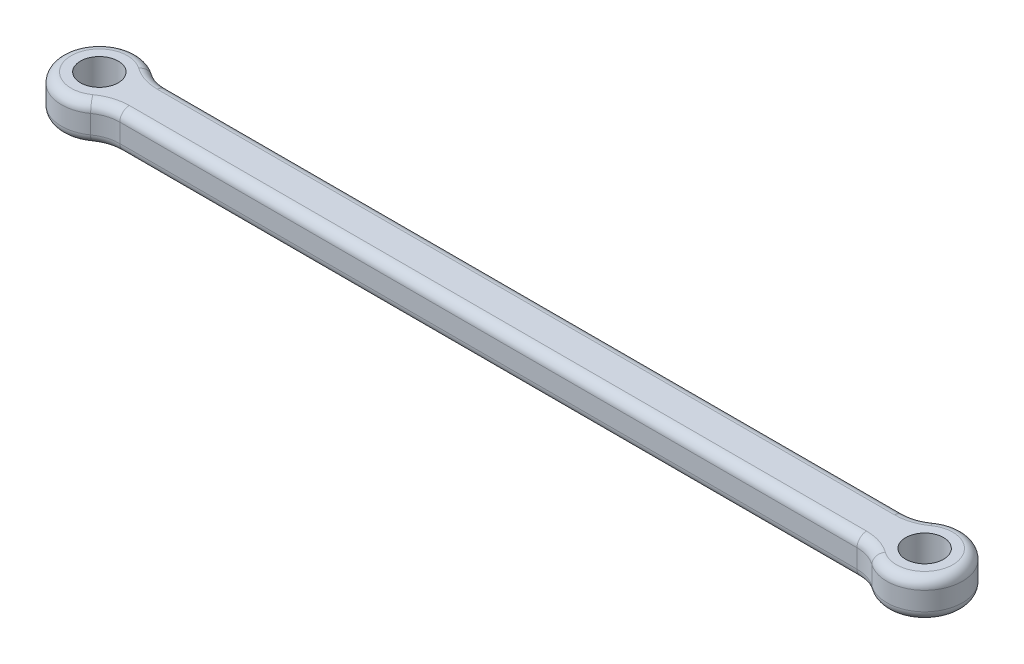
ISO-10303-21;
HEADER;
FILE_DESCRIPTION(('STEP AP214'),'2;1');
FILE_NAME('part.step','',(''),(''),'','','');
FILE_SCHEMA(('AUTOMOTIVE_DESIGN { 1 0 10303 214 1 1 1 1 }'));
ENDSEC;
DATA;
#1=APPLICATION_CONTEXT('core data for automotive mechanical design processes');
#2=APPLICATION_PROTOCOL_DEFINITION('international standard','automotive_design',2000,#1);
#3=PRODUCT_CONTEXT('',#1,'mechanical');
#4=PRODUCT('Part','Part','',(#3));
#5=PRODUCT_RELATED_PRODUCT_CATEGORY('part','',(#4));
#6=PRODUCT_DEFINITION_FORMATION('','',#4);
#7=PRODUCT_DEFINITION_CONTEXT('part definition',#1,'design');
#8=PRODUCT_DEFINITION('design','',#6,#7);
#9=PRODUCT_DEFINITION_SHAPE('','',#8);
#10=(LENGTH_UNIT() NAMED_UNIT(*) SI_UNIT(.MILLI.,.METRE.));
#11=(NAMED_UNIT(*) PLANE_ANGLE_UNIT() SI_UNIT($,.RADIAN.));
#12=(NAMED_UNIT(*) SI_UNIT($,.STERADIAN.) SOLID_ANGLE_UNIT());
#13=UNCERTAINTY_MEASURE_WITH_UNIT(LENGTH_MEASURE(1.E-05),#10,'distance_accuracy_value','');
#14=(GEOMETRIC_REPRESENTATION_CONTEXT(3) GLOBAL_UNCERTAINTY_ASSIGNED_CONTEXT((#13)) GLOBAL_UNIT_ASSIGNED_CONTEXT((#10,
#11,#12)) REPRESENTATION_CONTEXT('',''));
#15=CARTESIAN_POINT('',(0.,0.,0.));
#16=DIRECTION('',(0.,0.,1.));
#17=DIRECTION('',(1.,0.,0.));
#18=AXIS2_PLACEMENT_3D('',#15,#16,#17);
#19=CARTESIAN_POINT('',(-9.7801122812017,8.3,-10.725));
#20=DIRECTION('',(0.,1.,0.));
#21=DIRECTION('',(0.,0.,1.));
#22=AXIS2_PLACEMENT_3D('',#19,#20,#21);
#23=PLANE('',#22);
#24=CARTESIAN_POINT('',(119.000112281202,8.3,10.725));
#25=DIRECTION('',(0.,1.,0.));
#26=DIRECTION('',(0.,0.,1.));
#27=AXIS2_PLACEMENT_3D('',#24,#25,#26);
#28=CIRCLE('',#27,8.2764);
#29=CARTESIAN_POINT('',(119.000112281202,8.3,2.4486));
#30=VERTEX_POINT('',#29);
#31=CARTESIAN_POINT('',(123.824932280888,8.3,4.00042499999999));
#32=VERTEX_POINT('',#31);
#33=EDGE_CURVE('E268',#30,#32,#28,.F.);
#34=ORIENTED_EDGE('',*,*,#33,.T.);
#35=CARTESIAN_POINT('',(126.6952,8.3,0.));
#36=DIRECTION('',(0.,1.,0.));
#37=DIRECTION('',(0.,0.,1.));
#38=AXIS2_PLACEMENT_3D('',#35,#36,#37);
#39=CIRCLE('',#38,4.9236);
#40=CARTESIAN_POINT('',(123.824932280888,8.3,-4.00042499999999));
#41=VERTEX_POINT('',#40);
#42=EDGE_CURVE('E155',#32,#41,#39,.T.);
#43=ORIENTED_EDGE('',*,*,#42,.T.);
#44=CARTESIAN_POINT('',(119.000112281202,8.3,-10.725));
#45=DIRECTION('',(0.,1.,0.));
#46=DIRECTION('',(0.,0.,1.));
#47=AXIS2_PLACEMENT_3D('',#44,#45,#46);
#48=CIRCLE('',#47,8.2764);
#49=CARTESIAN_POINT('',(119.000112281202,8.3,-2.4486));
#50=VERTEX_POINT('',#49);
#51=EDGE_CURVE('E149',#41,#50,#48,.F.);
#52=ORIENTED_EDGE('',*,*,#51,.T.);
#53=DIRECTION('',(-1.,0.,0.));
#54=VECTOR('',#53,1.);
#55=CARTESIAN_POINT('',(-9.7801122812017,8.3,-2.4486));
#56=LINE('',#55,#54);
#57=CARTESIAN_POINT('',(-9.7801122812017,8.3,-2.4486));
#58=VERTEX_POINT('',#57);
#59=EDGE_CURVE('E152',#50,#58,#56,.T.);
#60=ORIENTED_EDGE('',*,*,#59,.T.);
#61=CARTESIAN_POINT('',(-9.7801122812017,8.3,-10.725));
#62=DIRECTION('',(0.,1.,0.));
#63=DIRECTION('',(0.,0.,1.));
#64=AXIS2_PLACEMENT_3D('',#61,#62,#63);
#65=CIRCLE('',#64,8.2764);
#66=CARTESIAN_POINT('',(-14.6049322808882,8.3,-4.000425));
#67=VERTEX_POINT('',#66);
#68=EDGE_CURVE('E159',#58,#67,#65,.F.);
#69=ORIENTED_EDGE('',*,*,#68,.T.);
#70=CARTESIAN_POINT('',(-17.4752,8.3,0.));
#71=DIRECTION('',(0.,1.,0.));
#72=DIRECTION('',(0.,0.,1.));
#73=AXIS2_PLACEMENT_3D('',#70,#71,#72);
#74=CIRCLE('',#73,4.9236);
#75=CARTESIAN_POINT('',(-14.6049322808882,8.3,4.000425));
#76=VERTEX_POINT('',#75);
#77=EDGE_CURVE('E274',#67,#76,#74,.T.);
#78=ORIENTED_EDGE('',*,*,#77,.T.);
#79=CARTESIAN_POINT('',(-9.7801122812017,8.3,10.725));
#80=DIRECTION('',(0.,1.,0.));
#81=DIRECTION('',(0.,0.,1.));
#82=AXIS2_PLACEMENT_3D('',#79,#80,#81);
#83=CIRCLE('',#82,8.2764);
#84=CARTESIAN_POINT('',(-9.7801122812017,8.3,2.4486));
#85=VERTEX_POINT('',#84);
#86=EDGE_CURVE('E272',#76,#85,#83,.F.);
#87=ORIENTED_EDGE('',*,*,#86,.T.);
#88=DIRECTION('',(1.,0.,0.));
#89=VECTOR('',#88,1.);
#90=CARTESIAN_POINT('',(119.000112281202,8.3,2.4486));
#91=LINE('',#90,#89);
#92=EDGE_CURVE('E270',#85,#30,#91,.T.);
#93=ORIENTED_EDGE('',*,*,#92,.T.);
#94=EDGE_LOOP('',(#34,#43,#52,#60,#69,#78,#87,#93));
#95=FACE_BOUND('',#94,.T.);
#96=CARTESIAN_POINT('',(-17.4752,8.3,0.));
#97=DIRECTION('',(0.,1.,0.));
#98=DIRECTION('',(0.,0.,1.));
#99=AXIS2_PLACEMENT_3D('',#96,#97,#98);
#100=CIRCLE('',#99,3.3);
#101=CARTESIAN_POINT('',(-17.4752,8.3,3.3));
#102=VERTEX_POINT('',#101);
#103=EDGE_CURVE('E298',#102,#102,#100,.T.);
#104=ORIENTED_EDGE('',*,*,#103,.F.);
#105=EDGE_LOOP('',(#104));
#106=FACE_BOUND('',#105,.T.);
#107=CARTESIAN_POINT('',(126.6952,8.3,0.));
#108=DIRECTION('',(0.,1.,0.));
#109=DIRECTION('',(0.,0.,-1.));
#110=AXIS2_PLACEMENT_3D('',#107,#108,#109);
#111=CIRCLE('',#110,3.29999999999999);
#112=CARTESIAN_POINT('',(126.6952,8.3,-3.29999999999999));
#113=VERTEX_POINT('',#112);
#114=EDGE_CURVE('E302',#113,#113,#111,.T.);
#115=ORIENTED_EDGE('',*,*,#114,.F.);
#116=EDGE_LOOP('',(#115));
#117=FACE_BOUND('',#116,.T.);
#118=ADVANCED_FACE('F34',(#95,#106,#117),#23,.T.);
#119=CARTESIAN_POINT('',(-9.7801122812017,1.7,-10.725));
#120=DIRECTION('',(0.,1.,0.));
#121=DIRECTION('',(0.,0.,1.));
#122=AXIS2_PLACEMENT_3D('',#119,#120,#121);
#123=PLANE('',#122);
#124=CARTESIAN_POINT('',(-9.7801122812017,1.7,10.725));
#125=DIRECTION('',(0.,1.,0.));
#126=DIRECTION('',(0.,0.,1.));
#127=AXIS2_PLACEMENT_3D('',#124,#125,#126);
#128=CIRCLE('',#127,8.2764);
#129=CARTESIAN_POINT('',(-9.7801122812017,1.7,2.4486));
#130=VERTEX_POINT('',#129);
#131=CARTESIAN_POINT('',(-14.6049322808882,1.7,4.000425));
#132=VERTEX_POINT('',#131);
#133=EDGE_CURVE('E227',#130,#132,#128,.T.);
#134=ORIENTED_EDGE('',*,*,#133,.T.);
#135=CARTESIAN_POINT('',(-17.4752,1.7,0.));
#136=DIRECTION('',(0.,1.,0.));
#137=DIRECTION('',(0.,0.,1.));
#138=AXIS2_PLACEMENT_3D('',#135,#136,#137);
#139=CIRCLE('',#138,4.9236);
#140=CARTESIAN_POINT('',(-14.6049322808882,1.7,-4.000425));
#141=VERTEX_POINT('',#140);
#142=EDGE_CURVE('E224',#132,#141,#139,.F.);
#143=ORIENTED_EDGE('',*,*,#142,.T.);
#144=CARTESIAN_POINT('',(-9.7801122812017,1.7,-10.725));
#145=DIRECTION('',(0.,1.,0.));
#146=DIRECTION('',(0.,0.,1.));
#147=AXIS2_PLACEMENT_3D('',#144,#145,#146);
#148=CIRCLE('',#147,8.2764);
#149=CARTESIAN_POINT('',(-9.7801122812017,1.7,-2.4486));
#150=VERTEX_POINT('',#149);
#151=EDGE_CURVE('E239',#141,#150,#148,.T.);
#152=ORIENTED_EDGE('',*,*,#151,.T.);
#153=DIRECTION('',(-1.,0.,0.));
#154=VECTOR('',#153,1.);
#155=CARTESIAN_POINT('',(-9.7801122812017,1.7,-2.4486));
#156=LINE('',#155,#154);
#157=CARTESIAN_POINT('',(119.000112281202,1.7,-2.4486));
#158=VERTEX_POINT('',#157);
#159=EDGE_CURVE('E237',#150,#158,#156,.F.);
#160=ORIENTED_EDGE('',*,*,#159,.T.);
#161=CARTESIAN_POINT('',(119.000112281202,1.7,-10.725));
#162=DIRECTION('',(0.,1.,0.));
#163=DIRECTION('',(0.,0.,1.));
#164=AXIS2_PLACEMENT_3D('',#161,#162,#163);
#165=CIRCLE('',#164,8.2764);
#166=CARTESIAN_POINT('',(123.824932280888,1.7,-4.00042499999999));
#167=VERTEX_POINT('',#166);
#168=EDGE_CURVE('E235',#158,#167,#165,.T.);
#169=ORIENTED_EDGE('',*,*,#168,.T.);
#170=CARTESIAN_POINT('',(126.6952,1.7,0.));
#171=DIRECTION('',(0.,1.,0.));
#172=DIRECTION('',(0.,0.,1.));
#173=AXIS2_PLACEMENT_3D('',#170,#171,#172);
#174=CIRCLE('',#173,4.9236);
#175=CARTESIAN_POINT('',(123.824932280888,1.7,4.00042499999999));
#176=VERTEX_POINT('',#175);
#177=EDGE_CURVE('E233',#167,#176,#174,.F.);
#178=ORIENTED_EDGE('',*,*,#177,.T.);
#179=CARTESIAN_POINT('',(119.000112281202,1.7,10.725));
#180=DIRECTION('',(0.,1.,0.));
#181=DIRECTION('',(0.,0.,1.));
#182=AXIS2_PLACEMENT_3D('',#179,#180,#181);
#183=CIRCLE('',#182,8.2764);
#184=CARTESIAN_POINT('',(119.000112281202,1.7,2.4486));
#185=VERTEX_POINT('',#184);
#186=EDGE_CURVE('E231',#176,#185,#183,.T.);
#187=ORIENTED_EDGE('',*,*,#186,.T.);
#188=DIRECTION('',(1.,0.,0.));
#189=VECTOR('',#188,1.);
#190=CARTESIAN_POINT('',(-9.7801122812017,1.7,2.4486));
#191=LINE('',#190,#189);
#192=EDGE_CURVE('E229',#185,#130,#191,.F.);
#193=ORIENTED_EDGE('',*,*,#192,.T.);
#194=EDGE_LOOP('',(#134,#143,#152,#160,#169,#178,#187,#193));
#195=FACE_BOUND('',#194,.T.);
#196=CARTESIAN_POINT('',(-17.4752,1.7,0.));
#197=DIRECTION('',(0.,1.,0.));
#198=DIRECTION('',(0.,0.,1.));
#199=AXIS2_PLACEMENT_3D('',#196,#197,#198);
#200=CIRCLE('',#199,3.3);
#201=CARTESIAN_POINT('',(-17.4752,1.7,3.3));
#202=VERTEX_POINT('',#201);
#203=EDGE_CURVE('E299',#202,#202,#200,.T.);
#204=ORIENTED_EDGE('',*,*,#203,.T.);
#205=EDGE_LOOP('',(#204));
#206=FACE_BOUND('',#205,.T.);
#207=CARTESIAN_POINT('',(126.6952,1.7,0.));
#208=DIRECTION('',(0.,1.,0.));
#209=DIRECTION('',(0.,0.,-1.));
#210=AXIS2_PLACEMENT_3D('',#207,#208,#209);
#211=CIRCLE('',#210,3.29999999999999);
#212=CARTESIAN_POINT('',(126.6952,1.7,-3.29999999999999));
#213=VERTEX_POINT('',#212);
#214=EDGE_CURVE('E192',#213,#213,#211,.T.);
#215=ORIENTED_EDGE('',*,*,#214,.T.);
#216=EDGE_LOOP('',(#215));
#217=FACE_BOUND('',#216,.T.);
#218=ADVANCED_FACE('F314',(#195,#206,#217),#123,.F.);
#219=CARTESIAN_POINT('',(-9.7801122812017,8.3,-10.725));
#220=DIRECTION('',(0.,-1.,0.));
#221=DIRECTION('',(0.,0.,-1.));
#222=AXIS2_PLACEMENT_3D('',#219,#220,#221);
#223=CYLINDRICAL_SURFACE('',#222,6.6);
#224=DIRECTION('',(0.,-1.,0.));
#225=VECTOR('',#224,1.);
#226=CARTESIAN_POINT('',(-13.6276561406008,8.3,-5.3625));
#227=LINE('',#226,#225);
#228=CARTESIAN_POINT('',(-13.6276561406008,6.6236,-5.3625));
#229=VERTEX_POINT('',#228);
#230=CARTESIAN_POINT('',(-13.6276561406008,3.3764,-5.3625));
#231=VERTEX_POINT('',#230);
#232=EDGE_CURVE('E169',#229,#231,#227,.T.);
#233=ORIENTED_EDGE('',*,*,#232,.F.);
#234=CARTESIAN_POINT('',(-9.7801122812017,6.6236,-10.725));
#235=DIRECTION('',(0.,1.,0.));
#236=DIRECTION('',(0.,0.,1.));
#237=AXIS2_PLACEMENT_3D('',#234,#235,#236);
#238=CIRCLE('',#237,6.6);
#239=CARTESIAN_POINT('',(-9.7801122812017,6.6236,-4.125));
#240=VERTEX_POINT('',#239);
#241=EDGE_CURVE('E241',#229,#240,#238,.T.);
#242=ORIENTED_EDGE('',*,*,#241,.T.);
#243=DIRECTION('',(0.,-1.,0.));
#244=VECTOR('',#243,1.);
#245=CARTESIAN_POINT('',(-9.7801122812017,8.3,-4.125));
#246=LINE('',#245,#244);
#247=CARTESIAN_POINT('',(-9.7801122812017,3.3764,-4.125));
#248=VERTEX_POINT('',#247);
#249=EDGE_CURVE('E295',#240,#248,#246,.T.);
#250=ORIENTED_EDGE('',*,*,#249,.T.);
#251=CARTESIAN_POINT('',(-9.7801122812017,3.3764,-10.725));
#252=DIRECTION('',(0.,1.,0.));
#253=DIRECTION('',(0.,0.,1.));
#254=AXIS2_PLACEMENT_3D('',#251,#252,#253);
#255=CIRCLE('',#254,6.6);
#256=EDGE_CURVE('E243',#248,#231,#255,.F.);
#257=ORIENTED_EDGE('',*,*,#256,.T.);
#258=EDGE_LOOP('',(#233,#242,#250,#257));
#259=FACE_BOUND('',#258,.T.);
#260=ADVANCED_FACE('F319',(#259),#223,.F.);
#261=CARTESIAN_POINT('',(-17.4752,8.3,0.));
#262=DIRECTION('',(0.,-1.,0.));
#263=DIRECTION('',(0.,0.,-1.));
#264=AXIS2_PLACEMENT_3D('',#261,#262,#263);
#265=CYLINDRICAL_SURFACE('',#264,6.6);
#266=DIRECTION('',(0.,-1.,0.));
#267=VECTOR('',#266,1.);
#268=CARTESIAN_POINT('',(-13.6276561406008,8.3,5.3625));
#269=LINE('',#268,#267);
#270=CARTESIAN_POINT('',(-13.6276561406008,6.6236,5.3625));
#271=VERTEX_POINT('',#270);
#272=CARTESIAN_POINT('',(-13.6276561406008,3.3764,5.3625));
#273=VERTEX_POINT('',#272);
#274=EDGE_CURVE('E279',#271,#273,#269,.T.);
#275=ORIENTED_EDGE('',*,*,#274,.F.);
#276=CARTESIAN_POINT('',(-17.4752,6.6236,0.));
#277=DIRECTION('',(0.,1.,0.));
#278=DIRECTION('',(0.,0.,1.));
#279=AXIS2_PLACEMENT_3D('',#276,#277,#278);
#280=CIRCLE('',#279,6.6);
#281=EDGE_CURVE('E245',#271,#229,#280,.F.);
#282=ORIENTED_EDGE('',*,*,#281,.T.);
#283=ORIENTED_EDGE('',*,*,#232,.T.);
#284=CARTESIAN_POINT('',(-17.4752,3.3764,0.));
#285=DIRECTION('',(0.,1.,0.));
#286=DIRECTION('',(0.,0.,1.));
#287=AXIS2_PLACEMENT_3D('',#284,#285,#286);
#288=CIRCLE('',#287,6.6);
#289=EDGE_CURVE('E247',#231,#273,#288,.T.);
#290=ORIENTED_EDGE('',*,*,#289,.T.);
#291=EDGE_LOOP('',(#275,#282,#283,#290));
#292=FACE_BOUND('',#291,.T.);
#293=ADVANCED_FACE('F347',(#292),#265,.T.);
#294=CARTESIAN_POINT('',(-9.7801122812017,8.3,10.725));
#295=DIRECTION('',(0.,-1.,0.));
#296=DIRECTION('',(0.,0.,-1.));
#297=AXIS2_PLACEMENT_3D('',#294,#295,#296);
#298=CYLINDRICAL_SURFACE('',#297,6.6);
#299=DIRECTION('',(0.,-1.,0.));
#300=VECTOR('',#299,1.);
#301=CARTESIAN_POINT('',(-9.7801122812017,8.3,4.125));
#302=LINE('',#301,#300);
#303=CARTESIAN_POINT('',(-9.7801122812017,6.6236,4.125));
#304=VERTEX_POINT('',#303);
#305=CARTESIAN_POINT('',(-9.7801122812017,3.3764,4.125));
#306=VERTEX_POINT('',#305);
#307=EDGE_CURVE('E282',#304,#306,#302,.T.);
#308=ORIENTED_EDGE('',*,*,#307,.F.);
#309=CARTESIAN_POINT('',(-9.7801122812017,6.6236,10.725));
#310=DIRECTION('',(0.,1.,0.));
#311=DIRECTION('',(0.,0.,1.));
#312=AXIS2_PLACEMENT_3D('',#309,#310,#311);
#313=CIRCLE('',#312,6.6);
#314=EDGE_CURVE('E250',#304,#271,#313,.T.);
#315=ORIENTED_EDGE('',*,*,#314,.T.);
#316=ORIENTED_EDGE('',*,*,#274,.T.);
#317=CARTESIAN_POINT('',(-9.7801122812017,3.3764,10.725));
#318=DIRECTION('',(0.,1.,0.));
#319=DIRECTION('',(0.,0.,1.));
#320=AXIS2_PLACEMENT_3D('',#317,#318,#319);
#321=CIRCLE('',#320,6.6);
#322=EDGE_CURVE('E252',#273,#306,#321,.F.);
#323=ORIENTED_EDGE('',*,*,#322,.T.);
#324=EDGE_LOOP('',(#308,#315,#316,#323));
#325=FACE_BOUND('',#324,.T.);
#326=ADVANCED_FACE('F343',(#325),#298,.F.);
#327=CARTESIAN_POINT('',(-9.7801122812017,8.3,4.125));
#328=DIRECTION('',(0.,0.,-1.));
#329=DIRECTION('',(-1.,0.,0.));
#330=AXIS2_PLACEMENT_3D('',#327,#328,#329);
#331=PLANE('',#330);
#332=DIRECTION('',(0.,-1.,0.));
#333=VECTOR('',#332,1.);
#334=CARTESIAN_POINT('',(119.000112281202,8.3,4.125));
#335=LINE('',#334,#333);
#336=CARTESIAN_POINT('',(119.000112281202,6.6236,4.125));
#337=VERTEX_POINT('',#336);
#338=CARTESIAN_POINT('',(119.000112281202,3.3764,4.125));
#339=VERTEX_POINT('',#338);
#340=EDGE_CURVE('E285',#337,#339,#335,.T.);
#341=ORIENTED_EDGE('',*,*,#340,.F.);
#342=DIRECTION('',(1.,0.,0.));
#343=VECTOR('',#342,1.);
#344=CARTESIAN_POINT('',(-9.7801122812017,6.6236,4.125));
#345=LINE('',#344,#343);
#346=EDGE_CURVE('E254',#337,#304,#345,.F.);
#347=ORIENTED_EDGE('',*,*,#346,.T.);
#348=ORIENTED_EDGE('',*,*,#307,.T.);
#349=DIRECTION('',(1.,0.,0.));
#350=VECTOR('',#349,1.);
#351=CARTESIAN_POINT('',(-9.7801122812017,3.3764,4.125));
#352=LINE('',#351,#350);
#353=EDGE_CURVE('E256',#306,#339,#352,.T.);
#354=ORIENTED_EDGE('',*,*,#353,.T.);
#355=EDGE_LOOP('',(#341,#347,#348,#354));
#356=FACE_BOUND('',#355,.T.);
#357=ADVANCED_FACE('F339',(#356),#331,.F.);
#358=CARTESIAN_POINT('',(119.000112281202,8.3,10.725));
#359=DIRECTION('',(0.,-1.,0.));
#360=DIRECTION('',(0.,0.,-1.));
#361=AXIS2_PLACEMENT_3D('',#358,#359,#360);
#362=CYLINDRICAL_SURFACE('',#361,6.6);
#363=DIRECTION('',(0.,-1.,0.));
#364=VECTOR('',#363,1.);
#365=CARTESIAN_POINT('',(122.847656140601,8.3,5.36249999999999));
#366=LINE('',#365,#364);
#367=CARTESIAN_POINT('',(122.847656140601,6.6236,5.36249999999999));
#368=VERTEX_POINT('',#367);
#369=CARTESIAN_POINT('',(122.847656140601,3.3764,5.36249999999999));
#370=VERTEX_POINT('',#369);
#371=EDGE_CURVE('E288',#368,#370,#366,.T.);
#372=ORIENTED_EDGE('',*,*,#371,.F.);
#373=CARTESIAN_POINT('',(119.000112281202,6.6236,10.725));
#374=DIRECTION('',(0.,1.,0.));
#375=DIRECTION('',(0.,0.,1.));
#376=AXIS2_PLACEMENT_3D('',#373,#374,#375);
#377=CIRCLE('',#376,6.6);
#378=EDGE_CURVE('E258',#368,#337,#377,.T.);
#379=ORIENTED_EDGE('',*,*,#378,.T.);
#380=ORIENTED_EDGE('',*,*,#340,.T.);
#381=CARTESIAN_POINT('',(119.000112281202,3.3764,10.725));
#382=DIRECTION('',(0.,1.,0.));
#383=DIRECTION('',(0.,0.,1.));
#384=AXIS2_PLACEMENT_3D('',#381,#382,#383);
#385=CIRCLE('',#384,6.6);
#386=EDGE_CURVE('E260',#339,#370,#385,.F.);
#387=ORIENTED_EDGE('',*,*,#386,.T.);
#388=EDGE_LOOP('',(#372,#379,#380,#387));
#389=FACE_BOUND('',#388,.T.);
#390=ADVANCED_FACE('F335',(#389),#362,.F.);
#391=CARTESIAN_POINT('',(126.6952,8.3,0.));
#392=DIRECTION('',(0.,-1.,0.));
#393=DIRECTION('',(0.,0.,-1.));
#394=AXIS2_PLACEMENT_3D('',#391,#392,#393);
#395=CYLINDRICAL_SURFACE('',#394,6.6);
#396=DIRECTION('',(0.,-1.,0.));
#397=VECTOR('',#396,1.);
#398=CARTESIAN_POINT('',(122.847656140601,8.3,-5.3625));
#399=LINE('',#398,#397);
#400=CARTESIAN_POINT('',(122.847656140601,6.6236,-5.3625));
#401=VERTEX_POINT('',#400);
#402=CARTESIAN_POINT('',(122.847656140601,3.3764,-5.3625));
#403=VERTEX_POINT('',#402);
#404=EDGE_CURVE('E291',#401,#403,#399,.T.);
#405=ORIENTED_EDGE('',*,*,#404,.F.);
#406=CARTESIAN_POINT('',(126.6952,6.6236,0.));
#407=DIRECTION('',(0.,1.,0.));
#408=DIRECTION('',(0.,0.,1.));
#409=AXIS2_PLACEMENT_3D('',#406,#407,#408);
#410=CIRCLE('',#409,6.6);
#411=EDGE_CURVE('E262',#401,#368,#410,.F.);
#412=ORIENTED_EDGE('',*,*,#411,.T.);
#413=ORIENTED_EDGE('',*,*,#371,.T.);
#414=CARTESIAN_POINT('',(126.6952,3.3764,0.));
#415=DIRECTION('',(0.,1.,0.));
#416=DIRECTION('',(0.,0.,1.));
#417=AXIS2_PLACEMENT_3D('',#414,#415,#416);
#418=CIRCLE('',#417,6.6);
#419=EDGE_CURVE('E265',#370,#403,#418,.T.);
#420=ORIENTED_EDGE('',*,*,#419,.T.);
#421=EDGE_LOOP('',(#405,#412,#413,#420));
#422=FACE_BOUND('',#421,.T.);
#423=ADVANCED_FACE('F332',(#422),#395,.T.);
#424=CARTESIAN_POINT('',(119.000112281202,8.3,-10.725));
#425=DIRECTION('',(0.,-1.,0.));
#426=DIRECTION('',(0.,0.,-1.));
#427=AXIS2_PLACEMENT_3D('',#424,#425,#426);
#428=CYLINDRICAL_SURFACE('',#427,6.6);
#429=ORIENTED_EDGE('',*,*,#404,.T.);
#430=CARTESIAN_POINT('',(119.000112281202,3.3764,-10.725));
#431=DIRECTION('',(0.,1.,0.));
#432=DIRECTION('',(0.,0.,1.));
#433=AXIS2_PLACEMENT_3D('',#430,#431,#432);
#434=CIRCLE('',#433,6.6);
#435=CARTESIAN_POINT('',(119.000112281202,3.3764,-4.125));
#436=VERTEX_POINT('',#435);
#437=EDGE_CURVE('E51',#403,#436,#434,.F.);
#438=ORIENTED_EDGE('',*,*,#437,.T.);
#439=DIRECTION('',(0.,-1.,0.));
#440=VECTOR('',#439,1.);
#441=CARTESIAN_POINT('',(119.000112281202,8.3,-4.125));
#442=LINE('',#441,#440);
#443=CARTESIAN_POINT('',(119.000112281202,6.6236,-4.125));
#444=VERTEX_POINT('',#443);
#445=EDGE_CURVE('E293',#444,#436,#442,.T.);
#446=ORIENTED_EDGE('',*,*,#445,.F.);
#447=CARTESIAN_POINT('',(119.000112281202,6.6236,-10.725));
#448=DIRECTION('',(0.,1.,0.));
#449=DIRECTION('',(0.,0.,1.));
#450=AXIS2_PLACEMENT_3D('',#447,#448,#449);
#451=CIRCLE('',#450,6.6);
#452=EDGE_CURVE('E172',#444,#401,#451,.T.);
#453=ORIENTED_EDGE('',*,*,#452,.T.);
#454=EDGE_LOOP('',(#429,#438,#446,#453));
#455=FACE_BOUND('',#454,.T.);
#456=ADVANCED_FACE('F329',(#455),#428,.F.);
#457=CARTESIAN_POINT('',(-9.7801122812017,8.3,-4.125));
#458=DIRECTION('',(0.,0.,1.));
#459=DIRECTION('',(1.,0.,0.));
#460=AXIS2_PLACEMENT_3D('',#457,#458,#459);
#461=PLANE('',#460);
#462=ORIENTED_EDGE('',*,*,#445,.T.);
#463=DIRECTION('',(-1.,0.,0.));
#464=VECTOR('',#463,1.);
#465=CARTESIAN_POINT('',(-9.7801122812017,3.3764,-4.125));
#466=LINE('',#465,#464);
#467=EDGE_CURVE('E11',#436,#248,#466,.T.);
#468=ORIENTED_EDGE('',*,*,#467,.T.);
#469=ORIENTED_EDGE('',*,*,#249,.F.);
#470=DIRECTION('',(-1.,0.,0.));
#471=VECTOR('',#470,1.);
#472=CARTESIAN_POINT('',(119.000112281202,6.6236,-4.125));
#473=LINE('',#472,#471);
#474=EDGE_CURVE('E43',#240,#444,#473,.F.);
#475=ORIENTED_EDGE('',*,*,#474,.T.);
#476=EDGE_LOOP('',(#462,#468,#469,#475));
#477=FACE_BOUND('',#476,.T.);
#478=ADVANCED_FACE('F326',(#477),#461,.F.);
#479=CARTESIAN_POINT('',(-17.4752,8.3,0.));
#480=DIRECTION('',(0.,-1.,0.));
#481=DIRECTION('',(0.,0.,-1.));
#482=AXIS2_PLACEMENT_3D('',#479,#480,#481);
#483=CYLINDRICAL_SURFACE('',#482,3.3);
#484=ORIENTED_EDGE('',*,*,#103,.T.);
#485=EDGE_LOOP('',(#484));
#486=FACE_BOUND('',#485,.T.);
#487=ORIENTED_EDGE('',*,*,#203,.F.);
#488=EDGE_LOOP('',(#487));
#489=FACE_BOUND('',#488,.T.);
#490=ADVANCED_FACE('F323',(#486,#489),#483,.F.);
#491=CARTESIAN_POINT('',(126.6952,8.3,0.));
#492=DIRECTION('',(0.,-1.,0.));
#493=DIRECTION('',(0.,0.,-1.));
#494=AXIS2_PLACEMENT_3D('',#491,#492,#493);
#495=CYLINDRICAL_SURFACE('',#494,3.29999999999999);
#496=ORIENTED_EDGE('',*,*,#114,.T.);
#497=EDGE_LOOP('',(#496));
#498=FACE_BOUND('',#497,.T.);
#499=ORIENTED_EDGE('',*,*,#214,.F.);
#500=EDGE_LOOP('',(#499));
#501=FACE_BOUND('',#500,.T.);
#502=ADVANCED_FACE('F310',(#498,#501),#495,.F.);
#503=CARTESIAN_POINT('',(-17.4752,6.6236,0.));
#504=DIRECTION('',(0.,1.,0.));
#505=DIRECTION('',(0.,0.,1.));
#506=AXIS2_PLACEMENT_3D('',#503,#504,#505);
#507=TOROIDAL_SURFACE('',#506,4.9236,1.6764);
#508=CARTESIAN_POINT('',(-14.6049322808882,6.6236,-4.000425));
#509=DIRECTION('',(0.812499999999999,0.,0.582961190818052));
#510=DIRECTION('',(0.582961190818052,0.,-0.812499999999999));
#511=AXIS2_PLACEMENT_3D('',#508,#509,#510);
#512=CIRCLE('',#511,1.6764);
#513=EDGE_CURVE('E186',#229,#67,#512,.T.);
#514=ORIENTED_EDGE('',*,*,#513,.F.);
#515=ORIENTED_EDGE('',*,*,#281,.F.);
#516=CARTESIAN_POINT('',(-14.6049322808882,6.6236,4.000425));
#517=DIRECTION('',(0.812499999999999,0.,-0.582961190818052));
#518=DIRECTION('',(-0.582961190818052,0.,-0.812499999999999));
#519=AXIS2_PLACEMENT_3D('',#516,#517,#518);
#520=CIRCLE('',#519,1.6764);
#521=EDGE_CURVE('E189',#76,#271,#520,.T.);
#522=ORIENTED_EDGE('',*,*,#521,.F.);
#523=ORIENTED_EDGE('',*,*,#77,.F.);
#524=EDGE_LOOP('',(#514,#515,#522,#523));
#525=FACE_BOUND('',#524,.T.);
#526=ADVANCED_FACE('F377',(#525),#507,.T.);
#527=CARTESIAN_POINT('',(-9.7801122812017,6.6236,10.725));
#528=DIRECTION('',(0.,1.,0.));
#529=DIRECTION('',(0.,0.,1.));
#530=AXIS2_PLACEMENT_3D('',#527,#528,#529);
#531=TOROIDAL_SURFACE('',#530,8.2764,1.6764);
#532=ORIENTED_EDGE('',*,*,#521,.T.);
#533=ORIENTED_EDGE('',*,*,#314,.F.);
#534=CARTESIAN_POINT('',(-9.7801122812017,6.6236,2.4486));
#535=DIRECTION('',(1.,0.,0.));
#536=DIRECTION('',(0.,0.,-1.));
#537=AXIS2_PLACEMENT_3D('',#534,#535,#536);
#538=CIRCLE('',#537,1.6764);
#539=EDGE_CURVE('E183',#85,#304,#538,.T.);
#540=ORIENTED_EDGE('',*,*,#539,.F.);
#541=ORIENTED_EDGE('',*,*,#86,.F.);
#542=EDGE_LOOP('',(#532,#533,#540,#541));
#543=FACE_BOUND('',#542,.T.);
#544=ADVANCED_FACE('F373',(#543),#531,.T.);
#545=CARTESIAN_POINT('',(-9.7801122812017,6.6236,-10.725));
#546=DIRECTION('',(0.,1.,0.));
#547=DIRECTION('',(0.,0.,1.));
#548=AXIS2_PLACEMENT_3D('',#545,#546,#547);
#549=TOROIDAL_SURFACE('',#548,8.2764,1.6764);
#550=ORIENTED_EDGE('',*,*,#513,.T.);
#551=ORIENTED_EDGE('',*,*,#68,.F.);
#552=CARTESIAN_POINT('',(-9.7801122812017,6.6236,-2.4486));
#553=DIRECTION('',(1.,0.,0.));
#554=DIRECTION('',(0.,0.,-1.));
#555=AXIS2_PLACEMENT_3D('',#552,#553,#554);
#556=CIRCLE('',#555,1.6764);
#557=EDGE_CURVE('E168',#240,#58,#556,.T.);
#558=ORIENTED_EDGE('',*,*,#557,.F.);
#559=ORIENTED_EDGE('',*,*,#241,.F.);
#560=EDGE_LOOP('',(#550,#551,#558,#559));
#561=FACE_BOUND('',#560,.T.);
#562=ADVANCED_FACE('F369',(#561),#549,.T.);
#563=CARTESIAN_POINT('',(-9.7801122812017,6.6236,2.4486));
#564=DIRECTION('',(-1.,0.,0.));
#565=DIRECTION('',(0.,0.,1.));
#566=AXIS2_PLACEMENT_3D('',#563,#564,#565);
#567=CYLINDRICAL_SURFACE('',#566,1.6764);
#568=ORIENTED_EDGE('',*,*,#539,.T.);
#569=ORIENTED_EDGE('',*,*,#346,.F.);
#570=CARTESIAN_POINT('',(119.000112281202,6.6236,2.4486));
#571=DIRECTION('',(1.,0.,0.));
#572=DIRECTION('',(0.,0.,-1.));
#573=AXIS2_PLACEMENT_3D('',#570,#571,#572);
#574=CIRCLE('',#573,1.6764);
#575=EDGE_CURVE('E173',#30,#337,#574,.T.);
#576=ORIENTED_EDGE('',*,*,#575,.F.);
#577=ORIENTED_EDGE('',*,*,#92,.F.);
#578=EDGE_LOOP('',(#568,#569,#576,#577));
#579=FACE_BOUND('',#578,.T.);
#580=ADVANCED_FACE('F366',(#579),#567,.T.);
#581=CARTESIAN_POINT('',(-9.7801122812017,6.6236,-2.4486));
#582=DIRECTION('',(1.,0.,0.));
#583=DIRECTION('',(0.,0.,-1.));
#584=AXIS2_PLACEMENT_3D('',#581,#582,#583);
#585=CYLINDRICAL_SURFACE('',#584,1.6764);
#586=ORIENTED_EDGE('',*,*,#557,.T.);
#587=ORIENTED_EDGE('',*,*,#59,.F.);
#588=CARTESIAN_POINT('',(119.000112281202,6.6236,-2.4486));
#589=DIRECTION('',(1.,0.,0.));
#590=DIRECTION('',(0.,0.,-1.));
#591=AXIS2_PLACEMENT_3D('',#588,#589,#590);
#592=CIRCLE('',#591,1.6764);
#593=EDGE_CURVE('E165',#444,#50,#592,.T.);
#594=ORIENTED_EDGE('',*,*,#593,.F.);
#595=ORIENTED_EDGE('',*,*,#474,.F.);
#596=EDGE_LOOP('',(#586,#587,#594,#595));
#597=FACE_BOUND('',#596,.T.);
#598=ADVANCED_FACE('F164',(#597),#585,.T.);
#599=CARTESIAN_POINT('',(119.000112281202,6.6236,10.725));
#600=DIRECTION('',(0.,1.,0.));
#601=DIRECTION('',(0.,0.,1.));
#602=AXIS2_PLACEMENT_3D('',#599,#600,#601);
#603=TOROIDAL_SURFACE('',#602,8.2764,1.6764);
#604=ORIENTED_EDGE('',*,*,#575,.T.);
#605=ORIENTED_EDGE('',*,*,#378,.F.);
#606=CARTESIAN_POINT('',(123.824932280888,6.6236,4.00042499999999));
#607=DIRECTION('',(0.812500000000003,0.,0.582961190818047));
#608=DIRECTION('',(0.582961190818047,0.,-0.812500000000003));
#609=AXIS2_PLACEMENT_3D('',#606,#607,#608);
#610=CIRCLE('',#609,1.6764);
#611=EDGE_CURVE('E174',#32,#368,#610,.T.);
#612=ORIENTED_EDGE('',*,*,#611,.F.);
#613=ORIENTED_EDGE('',*,*,#33,.F.);
#614=EDGE_LOOP('',(#604,#605,#612,#613));
#615=FACE_BOUND('',#614,.T.);
#616=ADVANCED_FACE('F360',(#615),#603,.T.);
#617=CARTESIAN_POINT('',(119.000112281202,6.6236,-10.725));
#618=DIRECTION('',(0.,1.,0.));
#619=DIRECTION('',(0.,0.,1.));
#620=AXIS2_PLACEMENT_3D('',#617,#618,#619);
#621=TOROIDAL_SURFACE('',#620,8.2764,1.6764);
#622=ORIENTED_EDGE('',*,*,#593,.T.);
#623=ORIENTED_EDGE('',*,*,#51,.F.);
#624=CARTESIAN_POINT('',(123.824932280888,6.6236,-4.00042499999999));
#625=DIRECTION('',(0.812500000000002,0.,-0.582961190818048));
#626=DIRECTION('',(-0.582961190818048,0.,-0.812500000000002));
#627=AXIS2_PLACEMENT_3D('',#624,#625,#626);
#628=CIRCLE('',#627,1.6764);
#629=EDGE_CURVE('E178',#401,#41,#628,.T.);
#630=ORIENTED_EDGE('',*,*,#629,.F.);
#631=ORIENTED_EDGE('',*,*,#452,.F.);
#632=EDGE_LOOP('',(#622,#623,#630,#631));
#633=FACE_BOUND('',#632,.T.);
#634=ADVANCED_FACE('F171',(#633),#621,.T.);
#635=CARTESIAN_POINT('',(126.6952,6.6236,0.));
#636=DIRECTION('',(0.,1.,0.));
#637=DIRECTION('',(0.,0.,1.));
#638=AXIS2_PLACEMENT_3D('',#635,#636,#637);
#639=TOROIDAL_SURFACE('',#638,4.9236,1.6764);
#640=ORIENTED_EDGE('',*,*,#611,.T.);
#641=ORIENTED_EDGE('',*,*,#411,.F.);
#642=ORIENTED_EDGE('',*,*,#629,.T.);
#643=ORIENTED_EDGE('',*,*,#42,.F.);
#644=EDGE_LOOP('',(#640,#641,#642,#643));
#645=FACE_BOUND('',#644,.T.);
#646=ADVANCED_FACE('F355',(#645),#639,.T.);
#647=CARTESIAN_POINT('',(126.6952,3.3764,0.));
#648=DIRECTION('',(0.,1.,0.));
#649=DIRECTION('',(0.,0.,1.));
#650=AXIS2_PLACEMENT_3D('',#647,#648,#649);
#651=TOROIDAL_SURFACE('',#650,4.9236,1.6764);
#652=CARTESIAN_POINT('',(123.824932280888,3.3764,4.00042499999999));
#653=DIRECTION('',(-0.812500000000003,0.,-0.582961190818047));
#654=DIRECTION('',(-0.582961190818047,0.,0.812500000000003));
#655=AXIS2_PLACEMENT_3D('',#652,#653,#654);
#656=CIRCLE('',#655,1.6764);
#657=EDGE_CURVE('E208',#176,#370,#656,.T.);
#658=ORIENTED_EDGE('',*,*,#657,.F.);
#659=ORIENTED_EDGE('',*,*,#177,.F.);
#660=CARTESIAN_POINT('',(123.824932280888,3.3764,-4.000425));
#661=DIRECTION('',(-0.812500000000002,0.,0.582961190818048));
#662=DIRECTION('',(0.582961190818048,0.,0.812500000000002));
#663=AXIS2_PLACEMENT_3D('',#660,#661,#662);
#664=CIRCLE('',#663,1.6764);
#665=EDGE_CURVE('E38',#403,#167,#664,.T.);
#666=ORIENTED_EDGE('',*,*,#665,.F.);
#667=ORIENTED_EDGE('',*,*,#419,.F.);
#668=EDGE_LOOP('',(#658,#659,#666,#667));
#669=FACE_BOUND('',#668,.T.);
#670=ADVANCED_FACE('F36',(#669),#651,.T.);
#671=CARTESIAN_POINT('',(119.000112281202,3.3764,-10.725));
#672=DIRECTION('',(0.,1.,0.));
#673=DIRECTION('',(0.,0.,1.));
#674=AXIS2_PLACEMENT_3D('',#671,#672,#673);
#675=TOROIDAL_SURFACE('',#674,8.2764,1.6764);
#676=ORIENTED_EDGE('',*,*,#665,.T.);
#677=ORIENTED_EDGE('',*,*,#168,.F.);
#678=CARTESIAN_POINT('',(119.000112281202,3.3764,-2.4486));
#679=DIRECTION('',(-1.,0.,0.));
#680=DIRECTION('',(0.,0.,1.));
#681=AXIS2_PLACEMENT_3D('',#678,#679,#680);
#682=CIRCLE('',#681,1.6764);
#683=EDGE_CURVE('E206',#436,#158,#682,.T.);
#684=ORIENTED_EDGE('',*,*,#683,.F.);
#685=ORIENTED_EDGE('',*,*,#437,.F.);
#686=EDGE_LOOP('',(#676,#677,#684,#685));
#687=FACE_BOUND('',#686,.T.);
#688=ADVANCED_FACE('F404',(#687),#675,.T.);
#689=CARTESIAN_POINT('',(119.000112281202,3.3764,10.725));
#690=DIRECTION('',(0.,1.,0.));
#691=DIRECTION('',(0.,0.,1.));
#692=AXIS2_PLACEMENT_3D('',#689,#690,#691);
#693=TOROIDAL_SURFACE('',#692,8.2764,1.6764);
#694=ORIENTED_EDGE('',*,*,#657,.T.);
#695=ORIENTED_EDGE('',*,*,#386,.F.);
#696=CARTESIAN_POINT('',(119.000112281202,3.3764,2.4486));
#697=DIRECTION('',(-1.,0.,0.));
#698=DIRECTION('',(0.,0.,1.));
#699=AXIS2_PLACEMENT_3D('',#696,#697,#698);
#700=CIRCLE('',#699,1.6764);
#701=EDGE_CURVE('E203',#185,#339,#700,.T.);
#702=ORIENTED_EDGE('',*,*,#701,.F.);
#703=ORIENTED_EDGE('',*,*,#186,.F.);
#704=EDGE_LOOP('',(#694,#695,#702,#703));
#705=FACE_BOUND('',#704,.T.);
#706=ADVANCED_FACE('F401',(#705),#693,.T.);
#707=CARTESIAN_POINT('',(-9.7801122812017,3.3764,-2.4486));
#708=DIRECTION('',(-1.,0.,0.));
#709=DIRECTION('',(0.,0.,1.));
#710=AXIS2_PLACEMENT_3D('',#707,#708,#709);
#711=CYLINDRICAL_SURFACE('',#710,1.6764);
#712=ORIENTED_EDGE('',*,*,#683,.T.);
#713=ORIENTED_EDGE('',*,*,#159,.F.);
#714=CARTESIAN_POINT('',(-9.7801122812017,3.3764,-2.4486));
#715=DIRECTION('',(-1.,0.,0.));
#716=DIRECTION('',(0.,0.,1.));
#717=AXIS2_PLACEMENT_3D('',#714,#715,#716);
#718=CIRCLE('',#717,1.6764);
#719=EDGE_CURVE('E200',#248,#150,#718,.T.);
#720=ORIENTED_EDGE('',*,*,#719,.F.);
#721=ORIENTED_EDGE('',*,*,#467,.F.);
#722=EDGE_LOOP('',(#712,#713,#720,#721));
#723=FACE_BOUND('',#722,.T.);
#724=ADVANCED_FACE('F397',(#723),#711,.T.);
#725=CARTESIAN_POINT('',(-9.7801122812017,3.3764,2.4486));
#726=DIRECTION('',(1.,0.,0.));
#727=DIRECTION('',(0.,0.,-1.));
#728=AXIS2_PLACEMENT_3D('',#725,#726,#727);
#729=CYLINDRICAL_SURFACE('',#728,1.6764);
#730=ORIENTED_EDGE('',*,*,#701,.T.);
#731=ORIENTED_EDGE('',*,*,#353,.F.);
#732=CARTESIAN_POINT('',(-9.7801122812017,3.3764,2.4486));
#733=DIRECTION('',(-1.,0.,0.));
#734=DIRECTION('',(0.,0.,1.));
#735=AXIS2_PLACEMENT_3D('',#732,#733,#734);
#736=CIRCLE('',#735,1.6764);
#737=EDGE_CURVE('E197',#130,#306,#736,.T.);
#738=ORIENTED_EDGE('',*,*,#737,.F.);
#739=ORIENTED_EDGE('',*,*,#192,.F.);
#740=EDGE_LOOP('',(#730,#731,#738,#739));
#741=FACE_BOUND('',#740,.T.);
#742=ADVANCED_FACE('F393',(#741),#729,.T.);
#743=CARTESIAN_POINT('',(-9.7801122812017,3.3764,-10.725));
#744=DIRECTION('',(0.,1.,0.));
#745=DIRECTION('',(0.,0.,1.));
#746=AXIS2_PLACEMENT_3D('',#743,#744,#745);
#747=TOROIDAL_SURFACE('',#746,8.2764,1.6764);
#748=ORIENTED_EDGE('',*,*,#719,.T.);
#749=ORIENTED_EDGE('',*,*,#151,.F.);
#750=CARTESIAN_POINT('',(-14.6049322808882,3.3764,-4.000425));
#751=DIRECTION('',(-0.812499999999999,0.,-0.582961190818052));
#752=DIRECTION('',(-0.582961190818052,0.,0.812499999999999));
#753=AXIS2_PLACEMENT_3D('',#750,#751,#752);
#754=CIRCLE('',#753,1.6764);
#755=EDGE_CURVE('E195',#231,#141,#754,.T.);
#756=ORIENTED_EDGE('',*,*,#755,.F.);
#757=ORIENTED_EDGE('',*,*,#256,.F.);
#758=EDGE_LOOP('',(#748,#749,#756,#757));
#759=FACE_BOUND('',#758,.T.);
#760=ADVANCED_FACE('F389',(#759),#747,.T.);
#761=CARTESIAN_POINT('',(-9.7801122812017,3.3764,10.725));
#762=DIRECTION('',(0.,1.,0.));
#763=DIRECTION('',(0.,0.,1.));
#764=AXIS2_PLACEMENT_3D('',#761,#762,#763);
#765=TOROIDAL_SURFACE('',#764,8.2764,1.6764);
#766=ORIENTED_EDGE('',*,*,#737,.T.);
#767=ORIENTED_EDGE('',*,*,#322,.F.);
#768=CARTESIAN_POINT('',(-14.6049322808882,3.3764,4.000425));
#769=DIRECTION('',(-0.812499999999999,0.,0.582961190818052));
#770=DIRECTION('',(0.582961190818052,0.,0.812499999999999));
#771=AXIS2_PLACEMENT_3D('',#768,#769,#770);
#772=CIRCLE('',#771,1.6764);
#773=EDGE_CURVE('E193',#132,#273,#772,.T.);
#774=ORIENTED_EDGE('',*,*,#773,.F.);
#775=ORIENTED_EDGE('',*,*,#133,.F.);
#776=EDGE_LOOP('',(#766,#767,#774,#775));
#777=FACE_BOUND('',#776,.T.);
#778=ADVANCED_FACE('F385',(#777),#765,.T.);
#779=CARTESIAN_POINT('',(-17.4752,3.3764,0.));
#780=DIRECTION('',(0.,1.,0.));
#781=DIRECTION('',(0.,0.,1.));
#782=AXIS2_PLACEMENT_3D('',#779,#780,#781);
#783=TOROIDAL_SURFACE('',#782,4.9236,1.6764);
#784=ORIENTED_EDGE('',*,*,#755,.T.);
#785=ORIENTED_EDGE('',*,*,#142,.F.);
#786=ORIENTED_EDGE('',*,*,#773,.T.);
#787=ORIENTED_EDGE('',*,*,#289,.F.);
#788=EDGE_LOOP('',(#784,#785,#786,#787));
#789=FACE_BOUND('',#788,.T.);
#790=ADVANCED_FACE('F382',(#789),#783,.T.);
#791=CLOSED_SHELL('',(#118,#218,#260,#293,#326,#357,#390,#423,#456,#478,#490,#502,#526,#544,
#562,#580,#598,#616,#634,#646,#670,#688,#706,#724,#742,#760,#778,#790));
#792=MANIFOLD_SOLID_BREP('B2',#791);
#793=ADVANCED_BREP_SHAPE_REPRESENTATION('',(#18,#792),#14);
#794=SHAPE_DEFINITION_REPRESENTATION(#9,#793);
ENDSEC;
END-ISO-10303-21;
